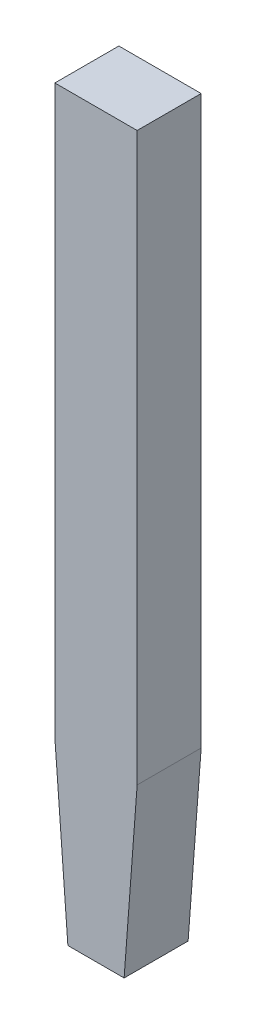
ISO-10303-21;
HEADER;
FILE_DESCRIPTION(('STEP AP214'),'2;1');
FILE_NAME('part.step','',(''),(''),'','','');
FILE_SCHEMA(('AUTOMOTIVE_DESIGN { 1 0 10303 214 1 1 1 1 }'));
ENDSEC;
DATA;
#1=APPLICATION_CONTEXT('core data for automotive mechanical design processes');
#2=APPLICATION_PROTOCOL_DEFINITION('international standard','automotive_design',2000,#1);
#3=PRODUCT_CONTEXT('',#1,'mechanical');
#4=PRODUCT('Part','Part','',(#3));
#5=PRODUCT_RELATED_PRODUCT_CATEGORY('part','',(#4));
#6=PRODUCT_DEFINITION_FORMATION('','',#4);
#7=PRODUCT_DEFINITION_CONTEXT('part definition',#1,'design');
#8=PRODUCT_DEFINITION('design','',#6,#7);
#9=PRODUCT_DEFINITION_SHAPE('','',#8);
#10=(LENGTH_UNIT() NAMED_UNIT(*) SI_UNIT(.MILLI.,.METRE.));
#11=(NAMED_UNIT(*) PLANE_ANGLE_UNIT() SI_UNIT($,.RADIAN.));
#12=(NAMED_UNIT(*) SI_UNIT($,.STERADIAN.) SOLID_ANGLE_UNIT());
#13=UNCERTAINTY_MEASURE_WITH_UNIT(LENGTH_MEASURE(1.E-05),#10,'distance_accuracy_value','');
#14=(GEOMETRIC_REPRESENTATION_CONTEXT(3) GLOBAL_UNCERTAINTY_ASSIGNED_CONTEXT((#13)) GLOBAL_UNIT_ASSIGNED_CONTEXT((#10,
#11,#12)) REPRESENTATION_CONTEXT('',''));
#15=CARTESIAN_POINT('',(0.,0.,0.));
#16=DIRECTION('',(0.,0.,1.));
#17=DIRECTION('',(1.,0.,0.));
#18=AXIS2_PLACEMENT_3D('',#15,#16,#17);
#19=CARTESIAN_POINT('',(52.95457889831,-0.5212621897839,0.8150000000459));
#20=DIRECTION('',(0.,0.,1.));
#21=DIRECTION('',(1.,0.,0.));
#22=AXIS2_PLACEMENT_3D('',#19,#20,#21);
#23=PLANE('',#22);
#24=DIRECTION('',(0.0747899482416288,0.997199309888457,0.));
#25=VECTOR('',#24,1.);
#26=CARTESIAN_POINT('',(53.55832889831,-15.17126218978,0.8150000000459));
#27=LINE('',#26,#25);
#28=CARTESIAN_POINT('',(53.55832889831,-15.17126218978,0.8150000000459));
#29=VERTEX_POINT('',#28);
#30=CARTESIAN_POINT('',(53.62957889831,-14.22126218978,0.8150000000459));
#31=VERTEX_POINT('',#30);
#32=EDGE_CURVE('E83',#29,#31,#27,.T.);
#33=ORIENTED_EDGE('',*,*,#32,.F.);
#34=DIRECTION('',(1.,0.,0.));
#35=VECTOR('',#34,1.);
#36=CARTESIAN_POINT('',(52.95457889831,-15.17126218978,0.8150000000459));
#37=LINE('',#36,#35);
#38=CARTESIAN_POINT('',(53.25082889831,-15.17126218978,0.8150000000459));
#39=VERTEX_POINT('',#38);
#40=EDGE_CURVE('E66',#39,#29,#37,.T.);
#41=ORIENTED_EDGE('',*,*,#40,.F.);
#42=DIRECTION('',(0.0747899482416288,-0.997199309888457,0.));
#43=VECTOR('',#42,1.);
#44=CARTESIAN_POINT('',(53.17957889831,-14.22126218978,0.8150000000459));
#45=LINE('',#44,#43);
#46=CARTESIAN_POINT('',(53.17957889831,-14.2212621897802,0.8150000000459));
#47=VERTEX_POINT('',#46);
#48=EDGE_CURVE('E20',#47,#39,#45,.T.);
#49=ORIENTED_EDGE('',*,*,#48,.F.);
#50=DIRECTION('',(0.,1.,0.));
#51=VECTOR('',#50,1.);
#52=CARTESIAN_POINT('',(53.17957889831,-7.321262189784,0.8150000000459));
#53=LINE('',#52,#51);
#54=CARTESIAN_POINT('',(53.17957889831,-11.12202888849,0.8150000000459));
#55=VERTEX_POINT('',#54);
#56=EDGE_CURVE('E96',#55,#47,#53,.F.);
#57=ORIENTED_EDGE('',*,*,#56,.F.);
#58=DIRECTION('',(1.,0.,0.));
#59=VECTOR('',#58,1.);
#60=CARTESIAN_POINT('',(44.47457889831,-11.12202888849,0.8150000000459));
#61=LINE('',#60,#59);
#62=CARTESIAN_POINT('',(53.62957889831,-11.12202888849,0.8150000000459));
#63=VERTEX_POINT('',#62);
#64=EDGE_CURVE('E89',#55,#63,#61,.T.);
#65=ORIENTED_EDGE('',*,*,#64,.T.);
#66=DIRECTION('',(0.,1.,0.));
#67=VECTOR('',#66,1.);
#68=CARTESIAN_POINT('',(53.62957889831,-7.321262189784,0.8150000000459));
#69=LINE('',#68,#67);
#70=EDGE_CURVE('E84',#31,#63,#69,.T.);
#71=ORIENTED_EDGE('',*,*,#70,.F.);
#72=EDGE_LOOP('',(#33,#41,#49,#57,#65,#71));
#73=FACE_BOUND('',#72,.T.);
#74=ADVANCED_FACE('F17',(#73),#23,.F.);
#75=CARTESIAN_POINT('',(53.62957889831,-7.321262189784,0.8150000000459));
#76=DIRECTION('',(1.,0.,0.));
#77=DIRECTION('',(0.,0.,-1.));
#78=AXIS2_PLACEMENT_3D('',#75,#76,#77);
#79=PLANE('',#78);
#80=DIRECTION('',(0.,1.,0.));
#81=VECTOR('',#80,1.);
#82=CARTESIAN_POINT('',(53.62957889831,-0.5212621897839,1.165000000046));
#83=LINE('',#82,#81);
#84=CARTESIAN_POINT('',(53.62957889831,-14.22126218978,1.165000000046));
#85=VERTEX_POINT('',#84);
#86=CARTESIAN_POINT('',(53.62957889831,-11.12202888849,1.165000000046));
#87=VERTEX_POINT('',#86);
#88=EDGE_CURVE('E103',#85,#87,#83,.T.);
#89=ORIENTED_EDGE('',*,*,#88,.F.);
#90=DIRECTION('',(0.,0.,1.));
#91=VECTOR('',#90,1.);
#92=CARTESIAN_POINT('',(53.62957889831,-14.22126218978,0.8150000000459));
#93=LINE('',#92,#91);
#94=EDGE_CURVE('E100',#31,#85,#93,.T.);
#95=ORIENTED_EDGE('',*,*,#94,.F.);
#96=ORIENTED_EDGE('',*,*,#70,.T.);
#97=DIRECTION('',(0.,0.,-1.));
#98=VECTOR('',#97,1.);
#99=CARTESIAN_POINT('',(53.62957889831,-11.12202888849,-0.158278306686));
#100=LINE('',#99,#98);
#101=EDGE_CURVE('E91',#63,#87,#100,.F.);
#102=ORIENTED_EDGE('',*,*,#101,.T.);
#103=EDGE_LOOP('',(#89,#95,#96,#102));
#104=FACE_BOUND('',#103,.T.);
#105=ADVANCED_FACE('F124',(#104),#79,.T.);
#106=CARTESIAN_POINT('',(44.47457889831,-11.12202888849,-0.158278306686));
#107=DIRECTION('',(0.,-1.,0.));
#108=DIRECTION('',(0.,0.,-1.));
#109=AXIS2_PLACEMENT_3D('',#106,#107,#108);
#110=PLANE('',#109);
#111=ORIENTED_EDGE('',*,*,#64,.F.);
#112=DIRECTION('',(0.,0.,1.));
#113=VECTOR('',#112,1.);
#114=CARTESIAN_POINT('',(53.17957889831,-11.12202888849,0.8150000000459));
#115=LINE('',#114,#113);
#116=CARTESIAN_POINT('',(53.17957889831,-11.12202888849,1.165000000046));
#117=VERTEX_POINT('',#116);
#118=EDGE_CURVE('E93',#117,#55,#115,.F.);
#119=ORIENTED_EDGE('',*,*,#118,.F.);
#120=DIRECTION('',(1.,0.,0.));
#121=VECTOR('',#120,1.);
#122=CARTESIAN_POINT('',(52.95457889831,-11.12202888849,1.165000000046));
#123=LINE('',#122,#121);
#124=EDGE_CURVE('E106',#87,#117,#123,.F.);
#125=ORIENTED_EDGE('',*,*,#124,.F.);
#126=ORIENTED_EDGE('',*,*,#101,.F.);
#127=EDGE_LOOP('',(#111,#119,#125,#126));
#128=FACE_BOUND('',#127,.T.);
#129=ADVANCED_FACE('F125',(#128),#110,.F.);
#130=CARTESIAN_POINT('',(53.17957889831,-7.321262189784,0.8150000000459));
#131=DIRECTION('',(-1.,0.,0.));
#132=DIRECTION('',(0.,0.,1.));
#133=AXIS2_PLACEMENT_3D('',#130,#131,#132);
#134=PLANE('',#133);
#135=ORIENTED_EDGE('',*,*,#56,.T.);
#136=DIRECTION('',(0.,0.,1.));
#137=VECTOR('',#136,1.);
#138=CARTESIAN_POINT('',(53.17957889831,-14.22126218978,0.8150000000459));
#139=LINE('',#138,#137);
#140=CARTESIAN_POINT('',(53.17957889831,-14.2212621897801,1.165000000046));
#141=VERTEX_POINT('',#140);
#142=EDGE_CURVE('E73',#141,#47,#139,.F.);
#143=ORIENTED_EDGE('',*,*,#142,.F.);
#144=DIRECTION('',(0.,1.,0.));
#145=VECTOR('',#144,1.);
#146=CARTESIAN_POINT('',(53.17957889831,-0.5212621897839,1.165000000046));
#147=LINE('',#146,#145);
#148=EDGE_CURVE('E109',#117,#141,#147,.F.);
#149=ORIENTED_EDGE('',*,*,#148,.F.);
#150=ORIENTED_EDGE('',*,*,#118,.T.);
#151=EDGE_LOOP('',(#135,#143,#149,#150));
#152=FACE_BOUND('',#151,.T.);
#153=ADVANCED_FACE('F119',(#152),#134,.T.);
#154=CARTESIAN_POINT('',(53.17957889831,-14.22126218978,0.8150000000459));
#155=DIRECTION('',(-0.997199309888458,-0.0747899482416168,0.));
#156=DIRECTION('',(0.0747899482416168,-0.997199309888458,0.));
#157=AXIS2_PLACEMENT_3D('',#154,#155,#156);
#158=PLANE('',#157);
#159=DIRECTION('',(0.0747899482416288,-0.997199309888457,0.));
#160=VECTOR('',#159,1.);
#161=CARTESIAN_POINT('',(53.17957889831,-14.22126218978,1.165000000046));
#162=LINE('',#161,#160);
#163=CARTESIAN_POINT('',(53.25082889831,-15.17126218978,1.165000000046));
#164=VERTEX_POINT('',#163);
#165=EDGE_CURVE('E112',#141,#164,#162,.T.);
#166=ORIENTED_EDGE('',*,*,#165,.F.);
#167=ORIENTED_EDGE('',*,*,#142,.T.);
#168=ORIENTED_EDGE('',*,*,#48,.T.);
#169=DIRECTION('',(0.,0.,1.));
#170=VECTOR('',#169,1.);
#171=CARTESIAN_POINT('',(53.25082889831,-15.17126218978,-0.8137967800219));
#172=LINE('',#171,#170);
#173=EDGE_CURVE('E72',#39,#164,#172,.T.);
#174=ORIENTED_EDGE('',*,*,#173,.T.);
#175=EDGE_LOOP('',(#166,#167,#168,#174));
#176=FACE_BOUND('',#175,.T.);
#177=ADVANCED_FACE('F71',(#176),#158,.T.);
#178=CARTESIAN_POINT('',(38.93957889831,-15.17126218978,-0.8137967800219));
#179=DIRECTION('',(0.,1.,0.));
#180=DIRECTION('',(0.,0.,1.));
#181=AXIS2_PLACEMENT_3D('',#178,#179,#180);
#182=PLANE('',#181);
#183=ORIENTED_EDGE('',*,*,#40,.T.);
#184=DIRECTION('',(0.,0.,1.));
#185=VECTOR('',#184,1.);
#186=CARTESIAN_POINT('',(53.55832889831,-15.17126218978,0.8150000000459));
#187=LINE('',#186,#185);
#188=CARTESIAN_POINT('',(53.55832889831,-15.17126218978,1.165000000046));
#189=VERTEX_POINT('',#188);
#190=EDGE_CURVE('E35',#189,#29,#187,.F.);
#191=ORIENTED_EDGE('',*,*,#190,.F.);
#192=DIRECTION('',(1.,0.,0.));
#193=VECTOR('',#192,1.);
#194=CARTESIAN_POINT('',(52.95457889831,-15.17126218978,1.165000000046));
#195=LINE('',#194,#193);
#196=EDGE_CURVE('E26',#164,#189,#195,.T.);
#197=ORIENTED_EDGE('',*,*,#196,.F.);
#198=ORIENTED_EDGE('',*,*,#173,.F.);
#199=EDGE_LOOP('',(#183,#191,#197,#198));
#200=FACE_BOUND('',#199,.T.);
#201=ADVANCED_FACE('F77',(#200),#182,.F.);
#202=CARTESIAN_POINT('',(53.62957889831,-14.22126218978,0.8150000000459));
#203=DIRECTION('',(0.997199309888458,-0.0747899482416168,0.));
#204=DIRECTION('',(0.0747899482416168,0.997199309888458,0.));
#205=AXIS2_PLACEMENT_3D('',#202,#203,#204);
#206=PLANE('',#205);
#207=ORIENTED_EDGE('',*,*,#32,.T.);
#208=ORIENTED_EDGE('',*,*,#94,.T.);
#209=DIRECTION('',(0.0747899482416288,0.997199309888457,0.));
#210=VECTOR('',#209,1.);
#211=CARTESIAN_POINT('',(53.55832889831,-15.17126218978,1.165000000046));
#212=LINE('',#211,#210);
#213=EDGE_CURVE('E11',#189,#85,#212,.T.);
#214=ORIENTED_EDGE('',*,*,#213,.F.);
#215=ORIENTED_EDGE('',*,*,#190,.T.);
#216=EDGE_LOOP('',(#207,#208,#214,#215));
#217=FACE_BOUND('',#216,.T.);
#218=ADVANCED_FACE('F127',(#217),#206,.T.);
#219=CARTESIAN_POINT('',(52.95457889831,-0.5212621897839,1.165000000046));
#220=DIRECTION('',(0.,0.,1.));
#221=DIRECTION('',(1.,0.,0.));
#222=AXIS2_PLACEMENT_3D('',#219,#220,#221);
#223=PLANE('',#222);
#224=ORIENTED_EDGE('',*,*,#196,.T.);
#225=ORIENTED_EDGE('',*,*,#213,.T.);
#226=ORIENTED_EDGE('',*,*,#88,.T.);
#227=ORIENTED_EDGE('',*,*,#124,.T.);
#228=ORIENTED_EDGE('',*,*,#148,.T.);
#229=ORIENTED_EDGE('',*,*,#165,.T.);
#230=EDGE_LOOP('',(#224,#225,#226,#227,#228,#229));
#231=FACE_BOUND('',#230,.T.);
#232=ADVANCED_FACE('F115',(#231),#223,.T.);
#233=CLOSED_SHELL('',(#74,#105,#129,#153,#177,#201,#218,#232));
#234=MANIFOLD_SOLID_BREP('B1',#233);
#235=ADVANCED_BREP_SHAPE_REPRESENTATION('',(#18,#234),#14);
#236=SHAPE_DEFINITION_REPRESENTATION(#9,#235);
ENDSEC;
END-ISO-10303-21;
